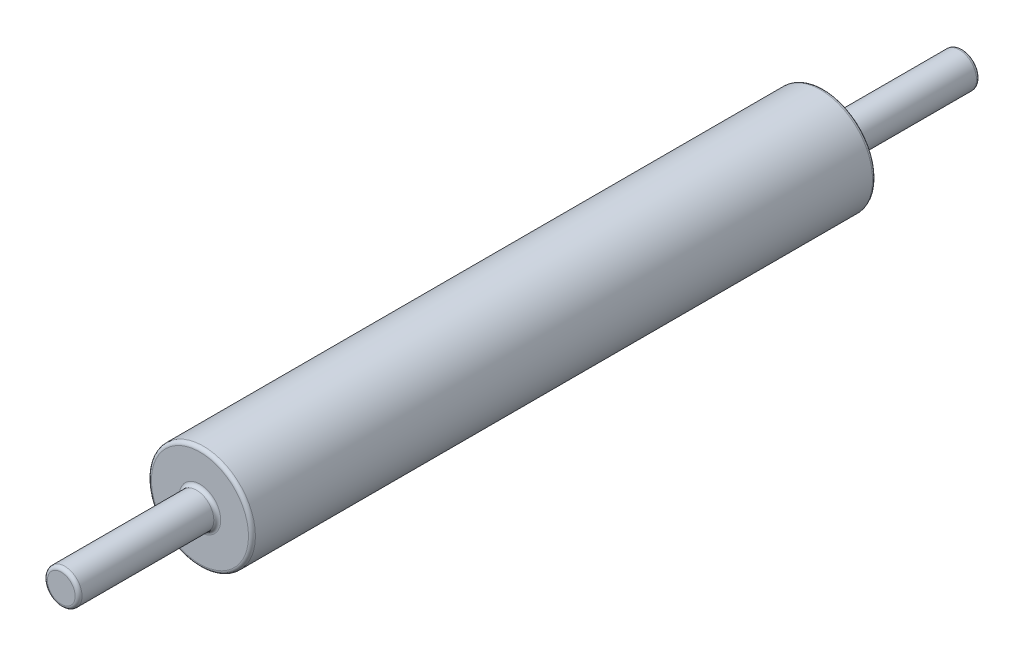
ISO-10303-21;
HEADER;
FILE_DESCRIPTION(('STEP AP214'),'2;1');
FILE_NAME('part.step','',(''),(''),'','','');
FILE_SCHEMA(('AUTOMOTIVE_DESIGN { 1 0 10303 214 1 1 1 1 }'));
ENDSEC;
DATA;
#1=APPLICATION_CONTEXT('core data for automotive mechanical design processes');
#2=APPLICATION_PROTOCOL_DEFINITION('international standard','automotive_design',2000,#1);
#3=PRODUCT_CONTEXT('',#1,'mechanical');
#4=PRODUCT('Part','Part','',(#3));
#5=PRODUCT_RELATED_PRODUCT_CATEGORY('part','',(#4));
#6=PRODUCT_DEFINITION_FORMATION('','',#4);
#7=PRODUCT_DEFINITION_CONTEXT('part definition',#1,'design');
#8=PRODUCT_DEFINITION('design','',#6,#7);
#9=PRODUCT_DEFINITION_SHAPE('','',#8);
#10=(LENGTH_UNIT() NAMED_UNIT(*) SI_UNIT(.MILLI.,.METRE.));
#11=(NAMED_UNIT(*) PLANE_ANGLE_UNIT() SI_UNIT($,.RADIAN.));
#12=(NAMED_UNIT(*) SI_UNIT($,.STERADIAN.) SOLID_ANGLE_UNIT());
#13=UNCERTAINTY_MEASURE_WITH_UNIT(LENGTH_MEASURE(1.E-05),#10,'distance_accuracy_value','');
#14=(GEOMETRIC_REPRESENTATION_CONTEXT(3) GLOBAL_UNCERTAINTY_ASSIGNED_CONTEXT((#13)) GLOBAL_UNIT_ASSIGNED_CONTEXT((#10,
#11,#12)) REPRESENTATION_CONTEXT('',''));
#15=CARTESIAN_POINT('',(0.,0.,0.));
#16=DIRECTION('',(0.,0.,1.));
#17=DIRECTION('',(1.,0.,0.));
#18=AXIS2_PLACEMENT_3D('',#15,#16,#17);
#19=CARTESIAN_POINT('',(0.,0.,457.2));
#20=DIRECTION('',(0.,0.,-1.));
#21=DIRECTION('',(-1.,0.,0.));
#22=AXIS2_PLACEMENT_3D('',#19,#20,#21);
#23=CYLINDRICAL_SURFACE('',#22,38.1);
#24=CARTESIAN_POINT('',(0.,0.,2.53999999999999));
#25=DIRECTION('',(0.,0.,1.));
#26=DIRECTION('',(1.,0.,0.));
#27=AXIS2_PLACEMENT_3D('',#24,#25,#26);
#28=CIRCLE('',#27,38.1);
#29=CARTESIAN_POINT('',(38.1,0.,2.53999999999999));
#30=VERTEX_POINT('',#29);
#31=EDGE_CURVE('E54',#30,#30,#28,.T.);
#32=ORIENTED_EDGE('',*,*,#31,.T.);
#33=EDGE_LOOP('',(#32));
#34=FACE_BOUND('',#33,.T.);
#35=CARTESIAN_POINT('',(0.,0.,454.66));
#36=DIRECTION('',(0.,0.,1.));
#37=DIRECTION('',(1.,0.,0.));
#38=AXIS2_PLACEMENT_3D('',#35,#36,#37);
#39=CIRCLE('',#38,38.1);
#40=CARTESIAN_POINT('',(38.1,0.,454.66));
#41=VERTEX_POINT('',#40);
#42=EDGE_CURVE('E59',#41,#41,#39,.F.);
#43=ORIENTED_EDGE('',*,*,#42,.T.);
#44=EDGE_LOOP('',(#43));
#45=FACE_BOUND('',#44,.T.);
#46=ADVANCED_FACE('F41',(#34,#45),#23,.T.);
#47=CARTESIAN_POINT('',(0.,0.,457.2));
#48=DIRECTION('',(0.,0.,1.));
#49=DIRECTION('',(1.,0.,0.));
#50=AXIS2_PLACEMENT_3D('',#47,#48,#49);
#51=PLANE('',#50);
#52=CARTESIAN_POINT('',(0.,0.,457.2));
#53=DIRECTION('',(0.,0.,1.));
#54=DIRECTION('',(1.,0.,0.));
#55=AXIS2_PLACEMENT_3D('',#52,#53,#54);
#56=CIRCLE('',#55,35.56);
#57=CARTESIAN_POINT('',(35.56,0.,457.2));
#58=VERTEX_POINT('',#57);
#59=EDGE_CURVE('E10',#58,#58,#56,.T.);
#60=ORIENTED_EDGE('',*,*,#59,.T.);
#61=EDGE_LOOP('',(#60));
#62=FACE_BOUND('',#61,.T.);
#63=CARTESIAN_POINT('',(0.,0.,457.2));
#64=DIRECTION('',(0.,0.,1.));
#65=DIRECTION('',(1.,0.,0.));
#66=AXIS2_PLACEMENT_3D('',#63,#64,#65);
#67=CIRCLE('',#66,15.24);
#68=CARTESIAN_POINT('',(15.24,0.,457.2));
#69=VERTEX_POINT('',#68);
#70=EDGE_CURVE('E81',#69,#69,#67,.F.);
#71=ORIENTED_EDGE('',*,*,#70,.T.);
#72=EDGE_LOOP('',(#71));
#73=FACE_BOUND('',#72,.T.);
#74=ADVANCED_FACE('F119',(#62,#73),#51,.T.);
#75=CARTESIAN_POINT('',(0.,0.,0.));
#76=DIRECTION('',(0.,0.,1.));
#77=DIRECTION('',(1.,0.,0.));
#78=AXIS2_PLACEMENT_3D('',#75,#76,#77);
#79=PLANE('',#78);
#80=CARTESIAN_POINT('',(0.,0.,0.));
#81=DIRECTION('',(0.,0.,1.));
#82=DIRECTION('',(1.,0.,0.));
#83=AXIS2_PLACEMENT_3D('',#80,#81,#82);
#84=CIRCLE('',#83,35.56);
#85=CARTESIAN_POINT('',(35.56,0.,0.));
#86=VERTEX_POINT('',#85);
#87=EDGE_CURVE('E49',#86,#86,#84,.F.);
#88=ORIENTED_EDGE('',*,*,#87,.T.);
#89=EDGE_LOOP('',(#88));
#90=FACE_BOUND('',#89,.T.);
#91=CARTESIAN_POINT('',(0.,0.,0.));
#92=DIRECTION('',(0.,0.,1.));
#93=DIRECTION('',(1.,0.,0.));
#94=AXIS2_PLACEMENT_3D('',#91,#92,#93);
#95=CIRCLE('',#94,15.24);
#96=CARTESIAN_POINT('',(15.24,0.,0.));
#97=VERTEX_POINT('',#96);
#98=EDGE_CURVE('E89',#97,#97,#95,.T.);
#99=ORIENTED_EDGE('',*,*,#98,.T.);
#100=EDGE_LOOP('',(#99));
#101=FACE_BOUND('',#100,.T.);
#102=ADVANCED_FACE('F124',(#90,#101),#79,.F.);
#103=CARTESIAN_POINT('',(0.,0.,-101.6));
#104=DIRECTION('',(0.,0.,1.));
#105=DIRECTION('',(1.,0.,0.));
#106=AXIS2_PLACEMENT_3D('',#103,#104,#105);
#107=CYLINDRICAL_SURFACE('',#106,12.7);
#108=CARTESIAN_POINT('',(0.,0.,-99.06));
#109=DIRECTION('',(0.,0.,-1.));
#110=DIRECTION('',(-1.,0.,0.));
#111=AXIS2_PLACEMENT_3D('',#108,#109,#110);
#112=CIRCLE('',#111,12.7);
#113=CARTESIAN_POINT('',(-12.7,0.,-99.06));
#114=VERTEX_POINT('',#113);
#115=EDGE_CURVE('E65',#114,#114,#112,.F.);
#116=ORIENTED_EDGE('',*,*,#115,.T.);
#117=EDGE_LOOP('',(#116));
#118=FACE_BOUND('',#117,.T.);
#119=CARTESIAN_POINT('',(0.,0.,-2.54));
#120=DIRECTION('',(0.,0.,1.));
#121=DIRECTION('',(1.,0.,0.));
#122=AXIS2_PLACEMENT_3D('',#119,#120,#121);
#123=CIRCLE('',#122,12.7);
#124=CARTESIAN_POINT('',(12.7,0.,-2.54));
#125=VERTEX_POINT('',#124);
#126=EDGE_CURVE('E93',#125,#125,#123,.F.);
#127=ORIENTED_EDGE('',*,*,#126,.T.);
#128=EDGE_LOOP('',(#127));
#129=FACE_BOUND('',#128,.T.);
#130=ADVANCED_FACE('F98',(#118,#129),#107,.T.);
#131=CARTESIAN_POINT('',(0.,0.,-101.6));
#132=DIRECTION('',(0.,0.,-1.));
#133=DIRECTION('',(-1.,0.,0.));
#134=AXIS2_PLACEMENT_3D('',#131,#132,#133);
#135=PLANE('',#134);
#136=CARTESIAN_POINT('',(0.,0.,-101.6));
#137=DIRECTION('',(0.,0.,-1.));
#138=DIRECTION('',(-1.,0.,0.));
#139=AXIS2_PLACEMENT_3D('',#136,#137,#138);
#140=CIRCLE('',#139,10.16);
#141=CARTESIAN_POINT('',(-10.16,0.,-101.6));
#142=VERTEX_POINT('',#141);
#143=EDGE_CURVE('E69',#142,#142,#140,.T.);
#144=ORIENTED_EDGE('',*,*,#143,.T.);
#145=EDGE_LOOP('',(#144));
#146=FACE_BOUND('',#145,.T.);
#147=ADVANCED_FACE('F132',(#146),#135,.T.);
#148=CARTESIAN_POINT('',(0.,0.,558.8));
#149=DIRECTION('',(0.,0.,-1.));
#150=DIRECTION('',(-1.,0.,0.));
#151=AXIS2_PLACEMENT_3D('',#148,#149,#150);
#152=CYLINDRICAL_SURFACE('',#151,12.7);
#153=CARTESIAN_POINT('',(0.,0.,556.26));
#154=DIRECTION('',(0.,0.,1.));
#155=DIRECTION('',(1.,0.,0.));
#156=AXIS2_PLACEMENT_3D('',#153,#154,#155);
#157=CIRCLE('',#156,12.7);
#158=CARTESIAN_POINT('',(12.7,0.,556.26));
#159=VERTEX_POINT('',#158);
#160=EDGE_CURVE('E73',#159,#159,#157,.F.);
#161=ORIENTED_EDGE('',*,*,#160,.T.);
#162=EDGE_LOOP('',(#161));
#163=FACE_BOUND('',#162,.T.);
#164=CARTESIAN_POINT('',(0.,0.,459.74));
#165=DIRECTION('',(0.,0.,1.));
#166=DIRECTION('',(1.,0.,0.));
#167=AXIS2_PLACEMENT_3D('',#164,#165,#166);
#168=CIRCLE('',#167,12.7);
#169=CARTESIAN_POINT('',(12.7,0.,459.74));
#170=VERTEX_POINT('',#169);
#171=EDGE_CURVE('E85',#170,#170,#168,.T.);
#172=ORIENTED_EDGE('',*,*,#171,.T.);
#173=EDGE_LOOP('',(#172));
#174=FACE_BOUND('',#173,.T.);
#175=ADVANCED_FACE('F113',(#163,#174),#152,.T.);
#176=CARTESIAN_POINT('',(0.,0.,558.8));
#177=DIRECTION('',(0.,0.,1.));
#178=DIRECTION('',(1.,0.,0.));
#179=AXIS2_PLACEMENT_3D('',#176,#177,#178);
#180=PLANE('',#179);
#181=CARTESIAN_POINT('',(0.,0.,558.8));
#182=DIRECTION('',(0.,0.,1.));
#183=DIRECTION('',(1.,0.,0.));
#184=AXIS2_PLACEMENT_3D('',#181,#182,#183);
#185=CIRCLE('',#184,10.16);
#186=CARTESIAN_POINT('',(10.16,0.,558.8));
#187=VERTEX_POINT('',#186);
#188=EDGE_CURVE('E77',#187,#187,#185,.T.);
#189=ORIENTED_EDGE('',*,*,#188,.T.);
#190=EDGE_LOOP('',(#189));
#191=FACE_BOUND('',#190,.T.);
#192=ADVANCED_FACE('F103',(#191),#180,.T.);
#193=CARTESIAN_POINT('',(0.,0.,-2.54));
#194=DIRECTION('',(0.,0.,1.));
#195=DIRECTION('',(1.,0.,0.));
#196=AXIS2_PLACEMENT_3D('',#193,#194,#195);
#197=TOROIDAL_SURFACE('',#196,15.24,2.54);
#198=ORIENTED_EDGE('',*,*,#98,.F.);
#199=EDGE_LOOP('',(#198));
#200=FACE_BOUND('',#199,.T.);
#201=ORIENTED_EDGE('',*,*,#126,.F.);
#202=EDGE_LOOP('',(#201));
#203=FACE_BOUND('',#202,.T.);
#204=ADVANCED_FACE('F100',(#200,#203),#197,.F.);
#205=CARTESIAN_POINT('',(0.,0.,459.74));
#206=DIRECTION('',(0.,0.,1.));
#207=DIRECTION('',(1.,0.,0.));
#208=AXIS2_PLACEMENT_3D('',#205,#206,#207);
#209=TOROIDAL_SURFACE('',#208,15.24,2.54);
#210=ORIENTED_EDGE('',*,*,#70,.F.);
#211=EDGE_LOOP('',(#210));
#212=FACE_BOUND('',#211,.T.);
#213=ORIENTED_EDGE('',*,*,#171,.F.);
#214=EDGE_LOOP('',(#213));
#215=FACE_BOUND('',#214,.T.);
#216=ADVANCED_FACE('F102',(#212,#215),#209,.F.);
#217=CARTESIAN_POINT('',(0.,0.,556.26));
#218=DIRECTION('',(0.,0.,1.));
#219=DIRECTION('',(1.,0.,0.));
#220=AXIS2_PLACEMENT_3D('',#217,#218,#219);
#221=TOROIDAL_SURFACE('',#220,10.16,2.54);
#222=ORIENTED_EDGE('',*,*,#160,.F.);
#223=EDGE_LOOP('',(#222));
#224=FACE_BOUND('',#223,.T.);
#225=ORIENTED_EDGE('',*,*,#188,.F.);
#226=EDGE_LOOP('',(#225));
#227=FACE_BOUND('',#226,.T.);
#228=ADVANCED_FACE('F110',(#224,#227),#221,.T.);
#229=CARTESIAN_POINT('',(0.,0.,-99.06));
#230=DIRECTION('',(0.,0.,-1.));
#231=DIRECTION('',(-1.,0.,0.));
#232=AXIS2_PLACEMENT_3D('',#229,#230,#231);
#233=TOROIDAL_SURFACE('',#232,10.16,2.54);
#234=ORIENTED_EDGE('',*,*,#115,.F.);
#235=EDGE_LOOP('',(#234));
#236=FACE_BOUND('',#235,.T.);
#237=ORIENTED_EDGE('',*,*,#143,.F.);
#238=EDGE_LOOP('',(#237));
#239=FACE_BOUND('',#238,.T.);
#240=ADVANCED_FACE('F148',(#236,#239),#233,.T.);
#241=CARTESIAN_POINT('',(0.,0.,2.53999999999999));
#242=DIRECTION('',(0.,0.,1.));
#243=DIRECTION('',(1.,0.,0.));
#244=AXIS2_PLACEMENT_3D('',#241,#242,#243);
#245=TOROIDAL_SURFACE('',#244,35.56,2.54);
#246=ORIENTED_EDGE('',*,*,#87,.F.);
#247=EDGE_LOOP('',(#246));
#248=FACE_BOUND('',#247,.T.);
#249=ORIENTED_EDGE('',*,*,#31,.F.);
#250=EDGE_LOOP('',(#249));
#251=FACE_BOUND('',#250,.T.);
#252=ADVANCED_FACE('F154',(#248,#251),#245,.T.);
#253=CARTESIAN_POINT('',(0.,0.,454.66));
#254=DIRECTION('',(0.,0.,1.));
#255=DIRECTION('',(1.,0.,0.));
#256=AXIS2_PLACEMENT_3D('',#253,#254,#255);
#257=TOROIDAL_SURFACE('',#256,35.56,2.54);
#258=ORIENTED_EDGE('',*,*,#42,.F.);
#259=EDGE_LOOP('',(#258));
#260=FACE_BOUND('',#259,.T.);
#261=ORIENTED_EDGE('',*,*,#59,.F.);
#262=EDGE_LOOP('',(#261));
#263=FACE_BOUND('',#262,.T.);
#264=ADVANCED_FACE('F43',(#260,#263),#257,.T.);
#265=CLOSED_SHELL('',(#46,#74,#102,#130,#147,#175,#192,#204,#216,#228,#240,#252,#264));
#266=MANIFOLD_SOLID_BREP('B2',#265);
#267=ADVANCED_BREP_SHAPE_REPRESENTATION('',(#18,#266),#14);
#268=SHAPE_DEFINITION_REPRESENTATION(#9,#267);
ENDSEC;
END-ISO-10303-21;
